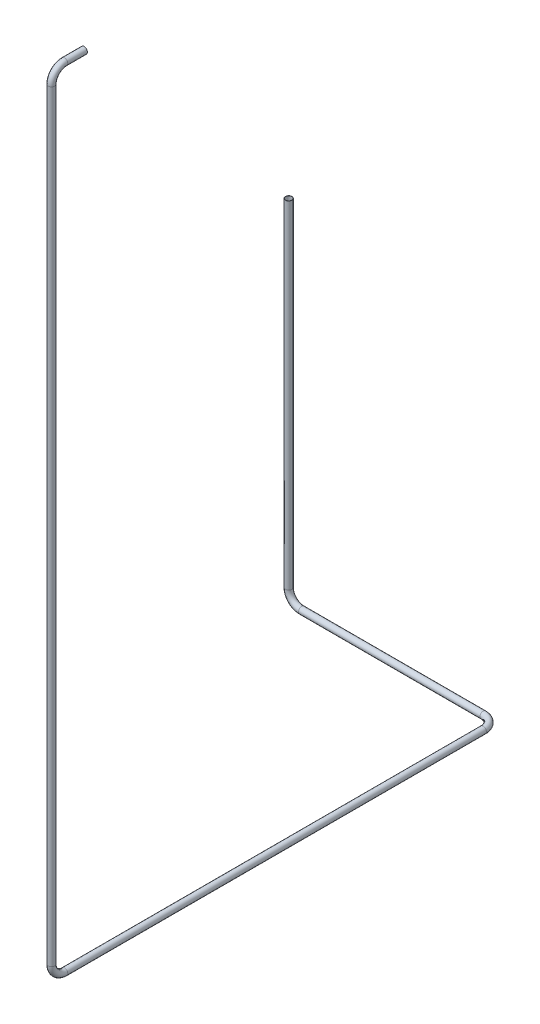
ISO-10303-21;
HEADER;
FILE_DESCRIPTION(('STEP AP214'),'2;1');
FILE_NAME('part.step','',(''),(''),'','','');
FILE_SCHEMA(('AUTOMOTIVE_DESIGN { 1 0 10303 214 1 1 1 1 }'));
ENDSEC;
DATA;
#1=APPLICATION_CONTEXT('core data for automotive mechanical design processes');
#2=APPLICATION_PROTOCOL_DEFINITION('international standard','automotive_design',2000,#1);
#3=PRODUCT_CONTEXT('',#1,'mechanical');
#4=PRODUCT('Part','Part','',(#3));
#5=PRODUCT_RELATED_PRODUCT_CATEGORY('part','',(#4));
#6=PRODUCT_DEFINITION_FORMATION('','',#4);
#7=PRODUCT_DEFINITION_CONTEXT('part definition',#1,'design');
#8=PRODUCT_DEFINITION('design','',#6,#7);
#9=PRODUCT_DEFINITION_SHAPE('','',#8);
#10=(LENGTH_UNIT() NAMED_UNIT(*) SI_UNIT(.MILLI.,.METRE.));
#11=(NAMED_UNIT(*) PLANE_ANGLE_UNIT() SI_UNIT($,.RADIAN.));
#12=(NAMED_UNIT(*) SI_UNIT($,.STERADIAN.) SOLID_ANGLE_UNIT());
#13=UNCERTAINTY_MEASURE_WITH_UNIT(LENGTH_MEASURE(1.E-05),#10,'distance_accuracy_value','');
#14=(GEOMETRIC_REPRESENTATION_CONTEXT(3) GLOBAL_UNCERTAINTY_ASSIGNED_CONTEXT((#13)) GLOBAL_UNIT_ASSIGNED_CONTEXT((#10,
#11,#12)) REPRESENTATION_CONTEXT('',''));
#15=CARTESIAN_POINT('',(0.,0.,0.));
#16=DIRECTION('',(0.,0.,1.));
#17=DIRECTION('',(1.,0.,0.));
#18=AXIS2_PLACEMENT_3D('',#15,#16,#17);
#19=CARTESIAN_POINT('',(-33126.1176832916,-14247.0136339342,43140.4701960568));
#20=DIRECTION('',(0.,0.,-1.));
#21=DIRECTION('',(1.,0.,0.));
#22=AXIS2_PLACEMENT_3D('',#19,#20,#21);
#23=PLANE('',#22);
#24=CARTESIAN_POINT('',(-33126.1176832916,-14247.0136339342,43140.4701960568));
#25=DIRECTION('',(0.,0.,-1.));
#26=DIRECTION('',(-1.,0.,0.));
#27=AXIS2_PLACEMENT_3D('',#24,#25,#26);
#28=CIRCLE('',#27,14.0000000000006);
#29=CARTESIAN_POINT('',(-33140.1176832916,-14247.0136339342,43140.4701960568));
#30=VERTEX_POINT('',#29);
#31=EDGE_CURVE('E88',#30,#30,#28,.T.);
#32=ORIENTED_EDGE('',*,*,#31,.F.);
#33=EDGE_LOOP('',(#32));
#34=FACE_BOUND('',#33,.T.);
#35=CARTESIAN_POINT('',(-33126.1176832916,-14247.0136339342,43140.4701960568));
#36=DIRECTION('',(0.,0.,-1.));
#37=DIRECTION('',(1.,0.,0.));
#38=AXIS2_PLACEMENT_3D('',#35,#36,#37);
#39=CIRCLE('',#38,15.0000000000006);
#40=CARTESIAN_POINT('',(-33111.1176832916,-14247.0136339342,43140.4701960568));
#41=VERTEX_POINT('',#40);
#42=EDGE_CURVE('E81',#41,#41,#39,.T.);
#43=ORIENTED_EDGE('',*,*,#42,.T.);
#44=EDGE_LOOP('',(#43));
#45=FACE_BOUND('',#44,.T.);
#46=ADVANCED_FACE('F47',(#34,#45),#23,.T.);
#47=CARTESIAN_POINT('',(-34078.2843054025,-16256.7025632948,41250.1350518645));
#48=DIRECTION('',(0.,-1.,0.));
#49=DIRECTION('',(0.,0.,-1.));
#50=AXIS2_PLACEMENT_3D('',#47,#48,#49);
#51=PLANE('',#50);
#52=CARTESIAN_POINT('',(-34078.2843054025,-16256.7025632948,41250.1350518645));
#53=DIRECTION('',(0.,-1.,0.));
#54=DIRECTION('',(0.,0.,-1.));
#55=AXIS2_PLACEMENT_3D('',#52,#53,#54);
#56=CIRCLE('',#55,14.0000000000006);
#57=CARTESIAN_POINT('',(-34078.2843054025,-16256.7025632948,41236.1350518645));
#58=VERTEX_POINT('',#57);
#59=EDGE_CURVE('E84',#58,#58,#56,.T.);
#60=ORIENTED_EDGE('',*,*,#59,.T.);
#61=EDGE_LOOP('',(#60));
#62=FACE_BOUND('',#61,.T.);
#63=CARTESIAN_POINT('',(-34078.2843054025,-16256.7025632948,41250.1350518645));
#64=DIRECTION('',(0.,-1.,0.));
#65=DIRECTION('',(0.,0.,-1.));
#66=AXIS2_PLACEMENT_3D('',#63,#64,#65);
#67=CIRCLE('',#66,15.0000000000006);
#68=CARTESIAN_POINT('',(-34078.2843054025,-16256.7025632948,41235.1350518645));
#69=VERTEX_POINT('',#68);
#70=EDGE_CURVE('E11',#69,#69,#67,.T.);
#71=ORIENTED_EDGE('',*,*,#70,.F.);
#72=EDGE_LOOP('',(#71));
#73=FACE_BOUND('',#72,.T.);
#74=ADVANCED_FACE('F126',(#62,#73),#51,.F.);
#75=CARTESIAN_POINT('',(-33126.1176832916,-14247.0136339342,43140.4701960568));
#76=DIRECTION('',(0.,0.,1.));
#77=DIRECTION('',(1.,0.,0.));
#78=AXIS2_PLACEMENT_3D('',#75,#76,#77);
#79=CYLINDRICAL_SURFACE('',#78,15.0000000000006);
#80=CARTESIAN_POINT('',(-33126.1176832916,-14247.0136339342,43230.4701960568));
#81=DIRECTION('',(0.,0.,-1.));
#82=DIRECTION('',(1.,0.,0.));
#83=AXIS2_PLACEMENT_3D('',#80,#81,#82);
#84=CIRCLE('',#83,15.0000000000006);
#85=CARTESIAN_POINT('',(-33126.1176832916,-14232.0136339342,43230.4701960568));
#86=VERTEX_POINT('',#85);
#87=EDGE_CURVE('E78',#86,#86,#84,.T.);
#88=ORIENTED_EDGE('',*,*,#87,.T.);
#89=EDGE_LOOP('',(#88));
#90=FACE_BOUND('',#89,.T.);
#91=ORIENTED_EDGE('',*,*,#42,.F.);
#92=EDGE_LOOP('',(#91));
#93=FACE_BOUND('',#92,.T.);
#94=ADVANCED_FACE('F130',(#90,#93),#79,.T.);
#95=CARTESIAN_POINT('',(-33126.1176832916,-14307.0136339342,43230.4701960568));
#96=DIRECTION('',(1.,0.,0.));
#97=DIRECTION('',(0.,0.,-1.));
#98=AXIS2_PLACEMENT_3D('',#95,#96,#97);
#99=TOROIDAL_SURFACE('',#98,60.0000000000023,15.0000000000006);
#100=CARTESIAN_POINT('',(-33126.1176832916,-14307.0136339342,43290.4701960568));
#101=DIRECTION('',(0.,1.,0.));
#102=DIRECTION('',(1.,0.,0.));
#103=AXIS2_PLACEMENT_3D('',#100,#101,#102);
#104=CIRCLE('',#103,15.0000000000006);
#105=CARTESIAN_POINT('',(-33126.1176832916,-14307.0136339342,43305.4701960568));
#106=VERTEX_POINT('',#105);
#107=EDGE_CURVE('E75',#106,#106,#104,.T.);
#108=CARTESIAN_POINT('',(-33126.1176832916,-14307.0136339342,43230.4701960568));
#109=DIRECTION('',(1.,0.,0.));
#110=DIRECTION('',(0.,0.,-1.));
#111=AXIS2_PLACEMENT_3D('',#108,#109,#110);
#112=CIRCLE('',#111,75.0000000000028);
#113=EDGE_CURVE('',#86,#106,#112,.T.);
#114=ORIENTED_EDGE('',*,*,#87,.F.);
#115=ORIENTED_EDGE('',*,*,#107,.T.);
#116=ORIENTED_EDGE('',*,*,#113,.T.);
#117=ORIENTED_EDGE('',*,*,#113,.F.);
#118=EDGE_LOOP('',(#114,#116,#115,#117));
#119=FACE_BOUND('',#118,.T.);
#120=ADVANCED_FACE('F132',(#119),#99,.T.);
#121=CARTESIAN_POINT('',(-33126.1176832916,-14307.0136339342,43290.4701960568));
#122=DIRECTION('',(0.,-1.,0.));
#123=DIRECTION('',(0.,0.,-1.));
#124=AXIS2_PLACEMENT_3D('',#121,#122,#123);
#125=CYLINDRICAL_SURFACE('',#124,15.0000000000006);
#126=CARTESIAN_POINT('',(-33126.1176832916,-17802.3317724565,43290.4701960568));
#127=DIRECTION('',(0.,1.,0.));
#128=DIRECTION('',(1.,0.,0.));
#129=AXIS2_PLACEMENT_3D('',#126,#127,#128);
#130=CIRCLE('',#129,15.0000000000006);
#131=CARTESIAN_POINT('',(-33126.1176832916,-17802.3317724565,43305.4701960568));
#132=VERTEX_POINT('',#131);
#133=EDGE_CURVE('E72',#132,#132,#130,.T.);
#134=ORIENTED_EDGE('',*,*,#133,.T.);
#135=EDGE_LOOP('',(#134));
#136=FACE_BOUND('',#135,.T.);
#137=ORIENTED_EDGE('',*,*,#107,.F.);
#138=EDGE_LOOP('',(#137));
#139=FACE_BOUND('',#138,.T.);
#140=ADVANCED_FACE('F139',(#136,#139),#125,.T.);
#141=CARTESIAN_POINT('',(-33126.1176832916,-17802.3317724565,43230.4701960568));
#142=DIRECTION('',(1.,0.,0.));
#143=DIRECTION('',(0.,0.,-1.));
#144=AXIS2_PLACEMENT_3D('',#141,#142,#143);
#145=TOROIDAL_SURFACE('',#144,60.0000000000023,15.0000000000006);
#146=CARTESIAN_POINT('',(-33126.1176832916,-17862.3317724565,43230.4701960568));
#147=DIRECTION('',(0.,1.18423789293353E-13,1.));
#148=DIRECTION('',(1.,0.,0.));
#149=AXIS2_PLACEMENT_3D('',#146,#147,#148);
#150=CIRCLE('',#149,15.0000000000006);
#151=CARTESIAN_POINT('',(-33126.1176832916,-17877.3317724565,43230.4701960568));
#152=VERTEX_POINT('',#151);
#153=EDGE_CURVE('E69',#152,#152,#150,.T.);
#154=CARTESIAN_POINT('',(-33126.1176832916,-17802.3317724565,43230.4701960568));
#155=DIRECTION('',(1.,0.,0.));
#156=DIRECTION('',(0.,0.,-1.));
#157=AXIS2_PLACEMENT_3D('',#154,#155,#156);
#158=CIRCLE('',#157,75.0000000000028);
#159=EDGE_CURVE('',#132,#152,#158,.T.);
#160=ORIENTED_EDGE('',*,*,#133,.F.);
#161=ORIENTED_EDGE('',*,*,#153,.T.);
#162=ORIENTED_EDGE('',*,*,#159,.T.);
#163=ORIENTED_EDGE('',*,*,#159,.F.);
#164=EDGE_LOOP('',(#160,#162,#161,#163));
#165=FACE_BOUND('',#164,.T.);
#166=ADVANCED_FACE('F164',(#165),#145,.T.);
#167=CARTESIAN_POINT('',(-33126.1176832916,-17862.3317724565,43230.4701960568));
#168=DIRECTION('',(0.,0.,-1.));
#169=DIRECTION('',(-1.,0.,0.));
#170=AXIS2_PLACEMENT_3D('',#167,#168,#169);
#171=CYLINDRICAL_SURFACE('',#170,15.0000000000006);
#172=CARTESIAN_POINT('',(-33126.1176832916,-17862.3317724565,41310.1350518645));
#173=DIRECTION('',(0.,0.,1.));
#174=DIRECTION('',(1.,0.,0.));
#175=AXIS2_PLACEMENT_3D('',#172,#173,#174);
#176=CIRCLE('',#175,15.0000000000006);
#177=CARTESIAN_POINT('',(-33111.1176832916,-17862.3317724565,41310.1350518645));
#178=VERTEX_POINT('',#177);
#179=EDGE_CURVE('E66',#178,#178,#176,.T.);
#180=ORIENTED_EDGE('',*,*,#179,.T.);
#181=EDGE_LOOP('',(#180));
#182=FACE_BOUND('',#181,.T.);
#183=ORIENTED_EDGE('',*,*,#153,.F.);
#184=EDGE_LOOP('',(#183));
#185=FACE_BOUND('',#184,.T.);
#186=ADVANCED_FACE('F160',(#182,#185),#171,.T.);
#187=CARTESIAN_POINT('',(-33186.1176832916,-17862.3317724565,41310.1350518645));
#188=DIRECTION('',(0.,1.,0.));
#189=DIRECTION('',(0.,0.,1.));
#190=AXIS2_PLACEMENT_3D('',#187,#188,#189);
#191=TOROIDAL_SURFACE('',#190,60.0000000000023,15.0000000000006);
#192=CARTESIAN_POINT('',(-33186.1176832916,-17862.3317724565,41250.1350518645));
#193=DIRECTION('',(1.,0.,0.));
#194=DIRECTION('',(0.,0.,-1.));
#195=AXIS2_PLACEMENT_3D('',#192,#193,#194);
#196=CIRCLE('',#195,15.0000000000006);
#197=CARTESIAN_POINT('',(-33186.1176832916,-17862.3317724565,41235.1350518645));
#198=VERTEX_POINT('',#197);
#199=EDGE_CURVE('E61',#198,#198,#196,.T.);
#200=CARTESIAN_POINT('',(-33186.1176832916,-17862.3317724565,41310.1350518645));
#201=DIRECTION('',(0.,1.,0.));
#202=DIRECTION('',(0.,0.,1.));
#203=AXIS2_PLACEMENT_3D('',#200,#201,#202);
#204=CIRCLE('',#203,75.0000000000028);
#205=EDGE_CURVE('',#178,#198,#204,.T.);
#206=ORIENTED_EDGE('',*,*,#179,.F.);
#207=ORIENTED_EDGE('',*,*,#199,.T.);
#208=ORIENTED_EDGE('',*,*,#205,.T.);
#209=ORIENTED_EDGE('',*,*,#205,.F.);
#210=EDGE_LOOP('',(#206,#208,#207,#209));
#211=FACE_BOUND('',#210,.T.);
#212=ADVANCED_FACE('F156',(#211),#191,.T.);
#213=CARTESIAN_POINT('',(-33186.1176832916,-17862.3317724565,41250.1350518645));
#214=DIRECTION('',(-1.,0.,0.));
#215=DIRECTION('',(0.,0.,1.));
#216=AXIS2_PLACEMENT_3D('',#213,#214,#215);
#217=CYLINDRICAL_SURFACE('',#216,15.0000000000006);
#218=CARTESIAN_POINT('',(-34018.2843054025,-17862.3317724565,41250.1350518645));
#219=DIRECTION('',(1.,0.,0.));
#220=DIRECTION('',(0.,0.,-1.));
#221=AXIS2_PLACEMENT_3D('',#218,#219,#220);
#222=CIRCLE('',#221,15.0000000000006);
#223=CARTESIAN_POINT('',(-34018.2843054025,-17877.3317724565,41250.1350518645));
#224=VERTEX_POINT('',#223);
#225=EDGE_CURVE('E57',#224,#224,#222,.T.);
#226=ORIENTED_EDGE('',*,*,#225,.T.);
#227=EDGE_LOOP('',(#226));
#228=FACE_BOUND('',#227,.T.);
#229=ORIENTED_EDGE('',*,*,#199,.F.);
#230=EDGE_LOOP('',(#229));
#231=FACE_BOUND('',#230,.T.);
#232=ADVANCED_FACE('F150',(#228,#231),#217,.T.);
#233=CARTESIAN_POINT('',(-34018.2843054025,-17802.3317724565,41250.1350518645));
#234=DIRECTION('',(0.,0.,-1.));
#235=DIRECTION('',(-1.,0.,0.));
#236=AXIS2_PLACEMENT_3D('',#233,#234,#235);
#237=TOROIDAL_SURFACE('',#236,59.9999999999987,15.0000000000006);
#238=CARTESIAN_POINT('',(-34078.2843054025,-17802.3317724565,41250.1350518645));
#239=DIRECTION('',(0.,-1.,0.));
#240=DIRECTION('',(0.,0.,-1.));
#241=AXIS2_PLACEMENT_3D('',#238,#239,#240);
#242=CIRCLE('',#241,15.0000000000006);
#243=CARTESIAN_POINT('',(-34093.2843054025,-17802.3317724565,41250.1350518645));
#244=VERTEX_POINT('',#243);
#245=EDGE_CURVE('E53',#244,#244,#242,.T.);
#246=CARTESIAN_POINT('',(-34018.2843054025,-17802.3317724565,41250.1350518645));
#247=DIRECTION('',(0.,0.,-1.));
#248=DIRECTION('',(-1.,0.,0.));
#249=AXIS2_PLACEMENT_3D('',#246,#247,#248);
#250=CIRCLE('',#249,74.9999999999993);
#251=EDGE_CURVE('',#224,#244,#250,.T.);
#252=ORIENTED_EDGE('',*,*,#225,.F.);
#253=ORIENTED_EDGE('',*,*,#245,.T.);
#254=ORIENTED_EDGE('',*,*,#251,.T.);
#255=ORIENTED_EDGE('',*,*,#251,.F.);
#256=EDGE_LOOP('',(#252,#254,#253,#255));
#257=FACE_BOUND('',#256,.T.);
#258=ADVANCED_FACE('F145',(#257),#237,.T.);
#259=CARTESIAN_POINT('',(-34078.2843054025,-17802.3317724565,41250.1350518645));
#260=DIRECTION('',(0.,1.,0.));
#261=DIRECTION('',(0.,0.,1.));
#262=AXIS2_PLACEMENT_3D('',#259,#260,#261);
#263=CYLINDRICAL_SURFACE('',#262,15.0000000000006);
#264=ORIENTED_EDGE('',*,*,#70,.T.);
#265=EDGE_LOOP('',(#264));
#266=FACE_BOUND('',#265,.T.);
#267=ORIENTED_EDGE('',*,*,#245,.F.);
#268=EDGE_LOOP('',(#267));
#269=FACE_BOUND('',#268,.T.);
#270=ADVANCED_FACE('F120',(#266,#269),#263,.T.);
#271=CARTESIAN_POINT('',(-33126.1176832916,-14247.0136339342,43140.4701960568));
#272=DIRECTION('',(0.,0.,1.));
#273=DIRECTION('',(1.,0.,0.));
#274=AXIS2_PLACEMENT_3D('',#271,#272,#273);
#275=CYLINDRICAL_SURFACE('',#274,14.0000000000006);
#276=CARTESIAN_POINT('',(-33126.1176832916,-14247.0136339342,43230.4701960568));
#277=DIRECTION('',(0.,0.,1.));
#278=DIRECTION('',(1.,0.,0.));
#279=AXIS2_PLACEMENT_3D('',#276,#277,#278);
#280=CIRCLE('',#279,14.0000000000006);
#281=CARTESIAN_POINT('',(-33126.1176832916,-14233.0136339342,43230.4701960568));
#282=VERTEX_POINT('',#281);
#283=EDGE_CURVE('E91',#282,#282,#280,.F.);
#284=ORIENTED_EDGE('',*,*,#283,.F.);
#285=EDGE_LOOP('',(#284));
#286=FACE_BOUND('',#285,.T.);
#287=ORIENTED_EDGE('',*,*,#31,.T.);
#288=EDGE_LOOP('',(#287));
#289=FACE_BOUND('',#288,.T.);
#290=ADVANCED_FACE('F117',(#286,#289),#275,.F.);
#291=CARTESIAN_POINT('',(-33126.1176832916,-14307.0136339342,43230.4701960568));
#292=DIRECTION('',(1.,0.,0.));
#293=DIRECTION('',(0.,0.,-1.));
#294=AXIS2_PLACEMENT_3D('',#291,#292,#293);
#295=TOROIDAL_SURFACE('',#294,60.0000000000023,14.0000000000006);
#296=CARTESIAN_POINT('',(-33126.1176832916,-14307.0136339342,43290.4701960568));
#297=DIRECTION('',(0.,1.,0.));
#298=DIRECTION('',(0.,0.,1.));
#299=AXIS2_PLACEMENT_3D('',#296,#297,#298);
#300=CIRCLE('',#299,14.0000000000006);
#301=CARTESIAN_POINT('',(-33126.1176832916,-14307.0136339342,43304.4701960568));
#302=VERTEX_POINT('',#301);
#303=EDGE_CURVE('E109',#302,#302,#300,.T.);
#304=CARTESIAN_POINT('',(-33126.1176832916,-14307.0136339342,43230.4701960568));
#305=DIRECTION('',(1.,0.,0.));
#306=DIRECTION('',(0.,0.,-1.));
#307=AXIS2_PLACEMENT_3D('',#304,#305,#306);
#308=CIRCLE('',#307,74.0000000000028);
#309=EDGE_CURVE('',#282,#302,#308,.T.);
#310=ORIENTED_EDGE('',*,*,#283,.T.);
#311=ORIENTED_EDGE('',*,*,#303,.F.);
#312=ORIENTED_EDGE('',*,*,#309,.T.);
#313=ORIENTED_EDGE('',*,*,#309,.F.);
#314=EDGE_LOOP('',(#310,#312,#311,#313));
#315=FACE_BOUND('',#314,.T.);
#316=ADVANCED_FACE('F115',(#315),#295,.F.);
#317=CARTESIAN_POINT('',(-33126.1176832916,-14307.0136339342,43290.4701960568));
#318=DIRECTION('',(0.,-1.,0.));
#319=DIRECTION('',(0.,0.,-1.));
#320=AXIS2_PLACEMENT_3D('',#317,#318,#319);
#321=CYLINDRICAL_SURFACE('',#320,14.0000000000006);
#322=CARTESIAN_POINT('',(-33126.1176832916,-17802.3317724565,43290.4701960568));
#323=DIRECTION('',(0.,-1.,0.));
#324=DIRECTION('',(0.,0.,-1.));
#325=AXIS2_PLACEMENT_3D('',#322,#323,#324);
#326=CIRCLE('',#325,14.0000000000006);
#327=CARTESIAN_POINT('',(-33126.1176832916,-17802.3317724565,43304.4701960568));
#328=VERTEX_POINT('',#327);
#329=EDGE_CURVE('E106',#328,#328,#326,.F.);
#330=ORIENTED_EDGE('',*,*,#329,.F.);
#331=EDGE_LOOP('',(#330));
#332=FACE_BOUND('',#331,.T.);
#333=ORIENTED_EDGE('',*,*,#303,.T.);
#334=EDGE_LOOP('',(#333));
#335=FACE_BOUND('',#334,.T.);
#336=ADVANCED_FACE('F223',(#332,#335),#321,.F.);
#337=CARTESIAN_POINT('',(-33126.1176832916,-17802.3317724565,43230.4701960568));
#338=DIRECTION('',(1.,0.,0.));
#339=DIRECTION('',(0.,0.,-1.));
#340=AXIS2_PLACEMENT_3D('',#337,#338,#339);
#341=TOROIDAL_SURFACE('',#340,60.0000000000023,14.0000000000006);
#342=CARTESIAN_POINT('',(-33126.1176832916,-17862.3317724565,43230.4701960568));
#343=DIRECTION('',(0.,1.19199605259689E-13,1.));
#344=DIRECTION('',(0.,-1.,1.19199605259689E-13));
#345=AXIS2_PLACEMENT_3D('',#342,#343,#344);
#346=CIRCLE('',#345,14.0000000000006);
#347=CARTESIAN_POINT('',(-33126.1176832916,-17876.3317724565,43230.4701960568));
#348=VERTEX_POINT('',#347);
#349=EDGE_CURVE('E103',#348,#348,#346,.T.);
#350=CARTESIAN_POINT('',(-33126.1176832916,-17802.3317724565,43230.4701960568));
#351=DIRECTION('',(1.,0.,0.));
#352=DIRECTION('',(0.,0.,-1.));
#353=AXIS2_PLACEMENT_3D('',#350,#351,#352);
#354=CIRCLE('',#353,74.0000000000028);
#355=EDGE_CURVE('',#328,#348,#354,.T.);
#356=ORIENTED_EDGE('',*,*,#329,.T.);
#357=ORIENTED_EDGE('',*,*,#349,.F.);
#358=ORIENTED_EDGE('',*,*,#355,.T.);
#359=ORIENTED_EDGE('',*,*,#355,.F.);
#360=EDGE_LOOP('',(#356,#358,#357,#359));
#361=FACE_BOUND('',#360,.T.);
#362=ADVANCED_FACE('F234',(#361),#341,.F.);
#363=CARTESIAN_POINT('',(-33126.1176832916,-17862.3317724565,43230.4701960568));
#364=DIRECTION('',(0.,0.,-1.));
#365=DIRECTION('',(-1.,0.,0.));
#366=AXIS2_PLACEMENT_3D('',#363,#364,#365);
#367=CYLINDRICAL_SURFACE('',#366,14.0000000000006);
#368=CARTESIAN_POINT('',(-33126.1176832916,-17862.3317724565,41310.1350518645));
#369=DIRECTION('',(0.,0.,-1.));
#370=DIRECTION('',(-1.,0.,0.));
#371=AXIS2_PLACEMENT_3D('',#368,#369,#370);
#372=CIRCLE('',#371,14.0000000000006);
#373=CARTESIAN_POINT('',(-33112.1176832916,-17862.3317724565,41310.1350518645));
#374=VERTEX_POINT('',#373);
#375=EDGE_CURVE('E100',#374,#374,#372,.F.);
#376=ORIENTED_EDGE('',*,*,#375,.F.);
#377=EDGE_LOOP('',(#376));
#378=FACE_BOUND('',#377,.T.);
#379=ORIENTED_EDGE('',*,*,#349,.T.);
#380=EDGE_LOOP('',(#379));
#381=FACE_BOUND('',#380,.T.);
#382=ADVANCED_FACE('F245',(#378,#381),#367,.F.);
#383=CARTESIAN_POINT('',(-33186.1176832916,-17862.3317724565,41310.1350518645));
#384=DIRECTION('',(0.,1.,0.));
#385=DIRECTION('',(0.,0.,1.));
#386=AXIS2_PLACEMENT_3D('',#383,#384,#385);
#387=TOROIDAL_SURFACE('',#386,60.0000000000023,14.0000000000006);
#388=CARTESIAN_POINT('',(-33186.1176832916,-17862.3317724565,41250.1350518645));
#389=DIRECTION('',(1.,0.,0.));
#390=DIRECTION('',(0.,0.,-1.));
#391=AXIS2_PLACEMENT_3D('',#388,#389,#390);
#392=CIRCLE('',#391,14.0000000000006);
#393=CARTESIAN_POINT('',(-33186.1176832916,-17862.3317724565,41236.1350518645));
#394=VERTEX_POINT('',#393);
#395=EDGE_CURVE('E97',#394,#394,#392,.T.);
#396=CARTESIAN_POINT('',(-33186.1176832916,-17862.3317724565,41310.1350518645));
#397=DIRECTION('',(0.,1.,0.));
#398=DIRECTION('',(0.,0.,1.));
#399=AXIS2_PLACEMENT_3D('',#396,#397,#398);
#400=CIRCLE('',#399,74.0000000000028);
#401=EDGE_CURVE('',#374,#394,#400,.T.);
#402=ORIENTED_EDGE('',*,*,#375,.T.);
#403=ORIENTED_EDGE('',*,*,#395,.F.);
#404=ORIENTED_EDGE('',*,*,#401,.T.);
#405=ORIENTED_EDGE('',*,*,#401,.F.);
#406=EDGE_LOOP('',(#402,#404,#403,#405));
#407=FACE_BOUND('',#406,.T.);
#408=ADVANCED_FACE('F256',(#407),#387,.F.);
#409=CARTESIAN_POINT('',(-33186.1176832916,-17862.3317724565,41250.1350518645));
#410=DIRECTION('',(-1.,0.,0.));
#411=DIRECTION('',(0.,0.,1.));
#412=AXIS2_PLACEMENT_3D('',#409,#410,#411);
#413=CYLINDRICAL_SURFACE('',#412,14.0000000000006);
#414=CARTESIAN_POINT('',(-34018.2843054025,-17862.3317724565,41250.1350518645));
#415=DIRECTION('',(-1.,0.,0.));
#416=DIRECTION('',(0.,0.,1.));
#417=AXIS2_PLACEMENT_3D('',#414,#415,#416);
#418=CIRCLE('',#417,14.0000000000006);
#419=CARTESIAN_POINT('',(-34018.2843054025,-17876.3317724565,41250.1350518645));
#420=VERTEX_POINT('',#419);
#421=EDGE_CURVE('E94',#420,#420,#418,.F.);
#422=ORIENTED_EDGE('',*,*,#421,.F.);
#423=EDGE_LOOP('',(#422));
#424=FACE_BOUND('',#423,.T.);
#425=ORIENTED_EDGE('',*,*,#395,.T.);
#426=EDGE_LOOP('',(#425));
#427=FACE_BOUND('',#426,.T.);
#428=ADVANCED_FACE('F267',(#424,#427),#413,.F.);
#429=CARTESIAN_POINT('',(-34018.2843054025,-17802.3317724565,41250.1350518645));
#430=DIRECTION('',(0.,0.,-1.));
#431=DIRECTION('',(-1.,0.,0.));
#432=AXIS2_PLACEMENT_3D('',#429,#430,#431);
#433=TOROIDAL_SURFACE('',#432,59.9999999999987,14.0000000000006);
#434=CARTESIAN_POINT('',(-34078.2843054025,-17802.3317724565,41250.1350518645));
#435=DIRECTION('',(0.,-1.,0.));
#436=DIRECTION('',(0.,0.,-1.));
#437=AXIS2_PLACEMENT_3D('',#434,#435,#436);
#438=CIRCLE('',#437,14.0000000000006);
#439=CARTESIAN_POINT('',(-34092.2843054025,-17802.3317724565,41250.1350518645));
#440=VERTEX_POINT('',#439);
#441=EDGE_CURVE('E87',#440,#440,#438,.T.);
#442=CARTESIAN_POINT('',(-34018.2843054025,-17802.3317724565,41250.1350518645));
#443=DIRECTION('',(0.,0.,-1.));
#444=DIRECTION('',(-1.,0.,0.));
#445=AXIS2_PLACEMENT_3D('',#442,#443,#444);
#446=CIRCLE('',#445,73.9999999999993);
#447=EDGE_CURVE('',#420,#440,#446,.T.);
#448=ORIENTED_EDGE('',*,*,#421,.T.);
#449=ORIENTED_EDGE('',*,*,#441,.F.);
#450=ORIENTED_EDGE('',*,*,#447,.T.);
#451=ORIENTED_EDGE('',*,*,#447,.F.);
#452=EDGE_LOOP('',(#448,#450,#449,#451));
#453=FACE_BOUND('',#452,.T.);
#454=ADVANCED_FACE('F278',(#453),#433,.F.);
#455=CARTESIAN_POINT('',(-34078.2843054025,-17802.3317724565,41250.1350518645));
#456=DIRECTION('',(0.,1.,0.));
#457=DIRECTION('',(0.,0.,1.));
#458=AXIS2_PLACEMENT_3D('',#455,#456,#457);
#459=CYLINDRICAL_SURFACE('',#458,14.0000000000006);
#460=ORIENTED_EDGE('',*,*,#59,.F.);
#461=EDGE_LOOP('',(#460));
#462=FACE_BOUND('',#461,.T.);
#463=ORIENTED_EDGE('',*,*,#441,.T.);
#464=EDGE_LOOP('',(#463));
#465=FACE_BOUND('',#464,.T.);
#466=ADVANCED_FACE('F127',(#462,#465),#459,.F.);
#467=CLOSED_SHELL('',(#46,#74,#94,#120,#140,#166,#186,#212,#232,#258,#270,#290,#316,#336,#362,
#382,#408,#428,#454,#466));
#468=MANIFOLD_SOLID_BREP('B2',#467);
#469=ADVANCED_BREP_SHAPE_REPRESENTATION('',(#18,#468),#14);
#470=SHAPE_DEFINITION_REPRESENTATION(#9,#469);
ENDSEC;
END-ISO-10303-21;
